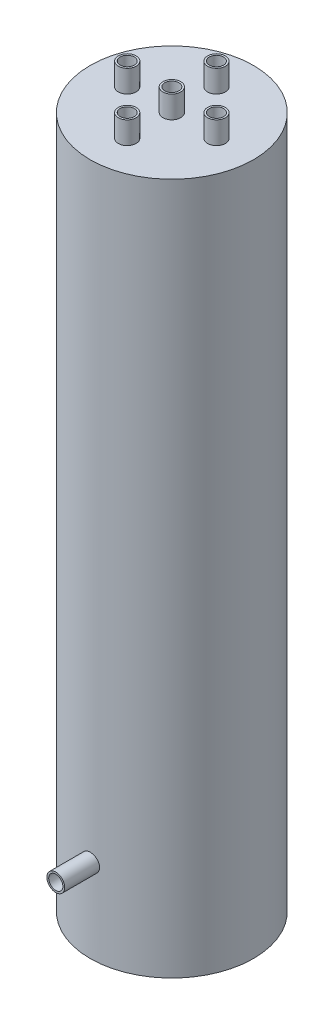
ISO-10303-21;
HEADER;
FILE_DESCRIPTION(('STEP AP214'),'2;1');
FILE_NAME('part.step','',(''),(''),'','','');
FILE_SCHEMA(('AUTOMOTIVE_DESIGN { 1 0 10303 214 1 1 1 1 }'));
ENDSEC;
DATA;
#1=APPLICATION_CONTEXT('core data for automotive mechanical design processes');
#2=APPLICATION_PROTOCOL_DEFINITION('international standard','automotive_design',2000,#1);
#3=PRODUCT_CONTEXT('',#1,'mechanical');
#4=PRODUCT('Part','Part','',(#3));
#5=PRODUCT_RELATED_PRODUCT_CATEGORY('part','',(#4));
#6=PRODUCT_DEFINITION_FORMATION('','',#4);
#7=PRODUCT_DEFINITION_CONTEXT('part definition',#1,'design');
#8=PRODUCT_DEFINITION('design','',#6,#7);
#9=PRODUCT_DEFINITION_SHAPE('','',#8);
#10=(LENGTH_UNIT() NAMED_UNIT(*) SI_UNIT(.MILLI.,.METRE.));
#11=(NAMED_UNIT(*) PLANE_ANGLE_UNIT() SI_UNIT($,.RADIAN.));
#12=(NAMED_UNIT(*) SI_UNIT($,.STERADIAN.) SOLID_ANGLE_UNIT());
#13=UNCERTAINTY_MEASURE_WITH_UNIT(LENGTH_MEASURE(1.E-05),#10,'distance_accuracy_value','');
#14=(GEOMETRIC_REPRESENTATION_CONTEXT(3) GLOBAL_UNCERTAINTY_ASSIGNED_CONTEXT((#13)) GLOBAL_UNIT_ASSIGNED_CONTEXT((#10,
#11,#12)) REPRESENTATION_CONTEXT('',''));
#15=CARTESIAN_POINT('',(0.,0.,0.));
#16=DIRECTION('',(0.,0.,1.));
#17=DIRECTION('',(1.,0.,0.));
#18=AXIS2_PLACEMENT_3D('',#15,#16,#17);
#19=CARTESIAN_POINT('',(0.,155.,0.));
#20=DIRECTION('',(0.,1.,0.));
#21=DIRECTION('',(0.,0.,1.));
#22=AXIS2_PLACEMENT_3D('',#19,#20,#21);
#23=PLANE('',#22);
#24=CARTESIAN_POINT('',(20.,155.,0.));
#25=DIRECTION('',(0.,1.,0.));
#26=DIRECTION('',(0.,0.,1.));
#27=AXIS2_PLACEMENT_3D('',#24,#25,#26);
#28=CIRCLE('',#27,4.);
#29=CARTESIAN_POINT('',(20.,155.,4.));
#30=VERTEX_POINT('',#29);
#31=EDGE_CURVE('E167',#30,#30,#28,.T.);
#32=ORIENTED_EDGE('',*,*,#31,.F.);
#33=EDGE_LOOP('',(#32));
#34=FACE_BOUND('',#33,.T.);
#35=CARTESIAN_POINT('',(0.,155.,20.));
#36=DIRECTION('',(0.,1.,0.));
#37=DIRECTION('',(0.,0.,1.));
#38=AXIS2_PLACEMENT_3D('',#35,#36,#37);
#39=CIRCLE('',#38,4.);
#40=CARTESIAN_POINT('',(0.,155.,24.));
#41=VERTEX_POINT('',#40);
#42=EDGE_CURVE('E191',#41,#41,#39,.T.);
#43=ORIENTED_EDGE('',*,*,#42,.F.);
#44=EDGE_LOOP('',(#43));
#45=FACE_BOUND('',#44,.T.);
#46=CARTESIAN_POINT('',(0.,155.,0.));
#47=DIRECTION('',(0.,1.,0.));
#48=DIRECTION('',(0.,0.,1.));
#49=AXIS2_PLACEMENT_3D('',#46,#47,#48);
#50=CIRCLE('',#49,36.6);
#51=CARTESIAN_POINT('',(0.,155.,36.6));
#52=VERTEX_POINT('',#51);
#53=EDGE_CURVE('E73',#52,#52,#50,.T.);
#54=ORIENTED_EDGE('',*,*,#53,.T.);
#55=EDGE_LOOP('',(#54));
#56=FACE_BOUND('',#55,.T.);
#57=CARTESIAN_POINT('',(0.,155.,0.));
#58=DIRECTION('',(0.,1.,0.));
#59=DIRECTION('',(0.,0.,1.));
#60=AXIS2_PLACEMENT_3D('',#57,#58,#59);
#61=CIRCLE('',#60,4.);
#62=CARTESIAN_POINT('',(0.,155.,4.));
#63=VERTEX_POINT('',#62);
#64=EDGE_CURVE('E150',#63,#63,#61,.T.);
#65=ORIENTED_EDGE('',*,*,#64,.F.);
#66=EDGE_LOOP('',(#65));
#67=FACE_BOUND('',#66,.T.);
#68=CARTESIAN_POINT('',(-20.,155.,0.));
#69=DIRECTION('',(0.,1.,0.));
#70=DIRECTION('',(0.,0.,1.));
#71=AXIS2_PLACEMENT_3D('',#68,#69,#70);
#72=CIRCLE('',#71,4.);
#73=CARTESIAN_POINT('',(-20.,155.,4.));
#74=VERTEX_POINT('',#73);
#75=EDGE_CURVE('E203',#74,#74,#72,.T.);
#76=ORIENTED_EDGE('',*,*,#75,.F.);
#77=EDGE_LOOP('',(#76));
#78=FACE_BOUND('',#77,.T.);
#79=CARTESIAN_POINT('',(0.,155.,-20.));
#80=DIRECTION('',(0.,1.,0.));
#81=DIRECTION('',(0.,0.,1.));
#82=AXIS2_PLACEMENT_3D('',#79,#80,#81);
#83=CIRCLE('',#82,4.);
#84=CARTESIAN_POINT('',(0.,155.,-16.));
#85=VERTEX_POINT('',#84);
#86=EDGE_CURVE('E179',#85,#85,#83,.T.);
#87=ORIENTED_EDGE('',*,*,#86,.F.);
#88=EDGE_LOOP('',(#87));
#89=FACE_BOUND('',#88,.T.);
#90=ADVANCED_FACE('F45',(#34,#45,#56,#67,#78,#89),#23,.T.);
#91=CARTESIAN_POINT('',(0.,140.,0.));
#92=DIRECTION('',(0.,-1.,0.));
#93=DIRECTION('',(0.,0.,-1.));
#94=AXIS2_PLACEMENT_3D('',#91,#92,#93);
#95=CYLINDRICAL_SURFACE('',#94,36.6);
#96=ORIENTED_EDGE('',*,*,#53,.F.);
#97=EDGE_LOOP('',(#96));
#98=FACE_BOUND('',#97,.T.);
#99=CARTESIAN_POINT('',(-4.,-117.704465642656,36.3807641481044));
#100=CARTESIAN_POINT('',(-3.99999035652888,-117.928426372424,36.3807669993321));
#101=CARTESIAN_POINT('',(-3.98112720598535,-118.152532387397,36.3828545094847));
#102=CARTESIAN_POINT('',(-3.9061679169019,-118.594522888859,36.3909771577017));
#103=CARTESIAN_POINT('',(-3.8500314810143,-118.812400375277,36.3970165681901));
#104=CARTESIAN_POINT('',(-3.70218690514282,-119.235469615529,36.4123509437496));
#105=CARTESIAN_POINT('',(-3.61050122084239,-119.440669282988,36.4216438532975));
#106=CARTESIAN_POINT('',(-3.39420570859501,-119.832725850075,36.4424356431216));
#107=CARTESIAN_POINT('',(-3.26960210363548,-120.019586207522,36.4539341063351));
#108=CARTESIAN_POINT('',(-2.99043106287914,-120.370508141754,36.4778969731229));
#109=CARTESIAN_POINT('',(-2.83575031431316,-120.534479341485,36.4903649190496));
#110=CARTESIAN_POINT('',(-2.5010587392878,-120.834189280795,36.5148298903671));
#111=CARTESIAN_POINT('',(-2.32104672027428,-120.969926690428,36.5268268935527));
#112=CARTESIAN_POINT('',(-1.94024302018696,-121.209633077633,36.5490337561589));
#113=CARTESIAN_POINT('',(-1.73940024547081,-121.313521345712,36.5592390476869));
#114=CARTESIAN_POINT('',(-1.32298996133603,-121.486063917528,36.5766739242199));
#115=CARTESIAN_POINT('',(-1.1074228756886,-121.554719234799,36.5839035948223));
#116=CARTESIAN_POINT('',(-0.668601044910458,-121.654579981154,36.59454774167));
#117=CARTESIAN_POINT('',(-0.445380629073005,-121.68593461916,36.5979774147296));
#118=CARTESIAN_POINT('',(0.00317858969439873,-121.710765901461,36.6006868992954));
#119=CARTESIAN_POINT('',(0.228517327642828,-121.704243703904,36.5999668376864));
#120=CARTESIAN_POINT('',(0.673902967808854,-121.653627039217,36.5944703713855));
#121=CARTESIAN_POINT('',(0.893968348562725,-121.609693023786,36.5897112895231));
#122=CARTESIAN_POINT('',(1.32358337108291,-121.485750108312,36.5766912759823));
#123=CARTESIAN_POINT('',(1.5331328537434,-121.40574066263,36.568430291338));
#124=CARTESIAN_POINT('',(1.93627038424834,-121.211743972346,36.549305187422));
#125=CARTESIAN_POINT('',(2.12982425983039,-121.097686268399,36.5384356793175));
#126=CARTESIAN_POINT('',(2.49510345127962,-120.83888192986,36.5153119568688));
#127=CARTESIAN_POINT('',(2.66682800146579,-120.694134219267,36.5030576939818));
#128=CARTESIAN_POINT('',(2.98451470707807,-120.377157610574,36.4784627538918));
#129=CARTESIAN_POINT('',(3.13033753097613,-120.204789042152,36.4661219597756));
#130=CARTESIAN_POINT('',(3.39100126516048,-119.837946329006,36.442808497001));
#131=CARTESIAN_POINT('',(3.5058421149103,-119.64347214109,36.4318358310158));
#132=CARTESIAN_POINT('',(3.70128428987256,-119.237825626607,36.4125004554348));
#133=CARTESIAN_POINT('',(3.78187612675795,-119.026648691915,36.4041384692703));
#134=CARTESIAN_POINT('',(3.90641773252441,-118.593648129357,36.390985939005));
#135=CARTESIAN_POINT('',(3.95036884038574,-118.371824890857,36.3861952643968));
#136=CARTESIAN_POINT('',(4.00020032405059,-117.925054197859,36.380750870905));
#137=CARTESIAN_POINT('',(4.00627602400726,-117.7001287776,36.3800759275167));
#138=CARTESIAN_POINT('',(3.98069802113483,-117.25246315781,36.3828833697791));
#139=CARTESIAN_POINT('',(3.94904492930606,-117.029722922949,36.3863656881048));
#140=CARTESIAN_POINT('',(3.84907164027095,-116.593325310592,36.3970759599516));
#141=CARTESIAN_POINT('',(3.78084456775558,-116.379646345875,36.4042943989576));
#142=CARTESIAN_POINT('',(3.60975537475998,-115.966764328915,36.4216558698257));
#143=CARTESIAN_POINT('',(3.50689231250161,-115.767561670473,36.4317989812108));
#144=CARTESIAN_POINT('',(3.26896488108602,-115.388398874915,36.4539181318825));
#145=CARTESIAN_POINT('',(3.13377154307566,-115.208520097532,36.4659014415928));
#146=CARTESIAN_POINT('',(2.83520517084069,-114.873937965385,36.4903273330595));
#147=CARTESIAN_POINT('',(2.67183130211562,-114.719235356418,36.502769928408));
#148=CARTESIAN_POINT('',(2.32069203685762,-114.438719075297,36.5267769055328));
#149=CARTESIAN_POINT('',(2.13282427500459,-114.31303314686,36.5383372593789));
#150=CARTESIAN_POINT('',(1.73853299261773,-114.094998702915,36.5592180549055));
#151=CARTESIAN_POINT('',(1.5321097688284,-114.002649654393,36.568538532398));
#152=CARTESIAN_POINT('',(1.10700563058654,-113.854124975946,36.5838713408991));
#153=CARTESIAN_POINT('',(0.888351529620701,-113.797873347466,36.5898906182551));
#154=CARTESIAN_POINT('',(0.444632432905874,-113.722892513877,36.5979714475269));
#155=CARTESIAN_POINT('',(0.219567655147246,-113.704162034428,36.6000331338551));
#156=CARTESIAN_POINT('',(-0.229331916796197,-113.704775125326,36.5999662238829));
#157=CARTESIAN_POINT('',(-0.453167010550648,-113.723920856505,36.5978594009884));
#158=CARTESIAN_POINT('',(-0.89441989290431,-113.799326594311,36.5897352414083));
#159=CARTESIAN_POINT('',(-1.11183767935968,-113.855586613337,36.5837179034164));
#160=CARTESIAN_POINT('',(-1.53407412202718,-114.003566480515,36.5684464577648));
#161=CARTESIAN_POINT('',(-1.73889529062642,-114.095279230884,36.5591929980254));
#162=CARTESIAN_POINT('',(-2.13026912503323,-114.311540464015,36.5384784200657));
#163=CARTESIAN_POINT('',(-2.31682178408818,-114.436088958914,36.5270173010294));
#164=CARTESIAN_POINT('',(-2.66737627612683,-114.715225290715,36.5030982063327));
#165=CARTESIAN_POINT('',(-2.83126041028886,-114.8699605418,36.4906355227707));
#166=CARTESIAN_POINT('',(-3.1308203376118,-115.204779787501,36.4661571232197));
#167=CARTESIAN_POINT('',(-3.26648938611352,-115.384869825824,36.4541415146638));
#168=CARTESIAN_POINT('',(-3.5060991158987,-115.765887491489,36.4318794042668));
#169=CARTESIAN_POINT('',(-3.6099438286756,-115.966875745056,36.4216382931272));
#170=CARTESIAN_POINT('',(-3.78226745332456,-116.383426346305,36.4041484324315));
#171=CARTESIAN_POINT('',(-3.85078576417122,-116.598972153288,36.3968963510772));
#172=CARTESIAN_POINT('',(-3.93365965674848,-116.963830602533,36.3880111821422));
#173=CARTESIAN_POINT('',(-3.95850268084169,-117.110820671771,36.3853066293041));
#174=CARTESIAN_POINT('',(-3.99167601523004,-117.406674300319,36.3816821689987));
#175=CARTESIAN_POINT('',(-4.00000641264597,-117.555537849741,36.3807622521156));
#176=CARTESIAN_POINT('',(-4.,-117.704465642656,36.3807641481044));
#177=B_SPLINE_CURVE_WITH_KNOTS('',3,(#99,#100,#101,#102,#103,#104,#105,#106,#107,#108,#109,#110,
#111,#112,#113,#114,#115,#116,#117,#118,#119,#120,#121,#122,#123,#124,#125,#126,#127,#128,#129,
#130,#131,#132,#133,#134,#135,#136,#137,#138,#139,#140,#141,#142,#143,#144,#145,#146,#147,#148,
#149,#150,#151,#152,#153,#154,#155,#156,#157,#158,#159,#160,#161,#162,#163,#164,#165,#166,#167,
#168,#169,#170,#171,#172,#173,#174,#175,#176),.UNSPECIFIED.,.T.,.F.,(4,2,2,2,2,2,2,2,2,2,2,2,2,
2,2,2,2,2,2,2,2,2,2,2,2,2,2,2,2,2,2,2,2,2,2,2,2,2,4),(0.,0.671338265123541,1.34340352002231,
2.01504493580429,2.68655947149108,3.36065468370503,4.03478164182587,4.71060305945429,
5.3864050348775,6.05949450125936,6.73256338693227,7.40276007174004,8.07296689358674,
8.74457036860916,9.41619739416307,10.0913345197562,10.7664729645076,11.4417983274901,
12.1170990106427,12.7889142554371,13.4607186206421,14.1308205059564,14.8009406133074,
15.4737798508492,16.1466390163716,16.8224061887043,17.4981625558876,18.1724914948341,
18.8467975310298,19.517590756934,20.1883842069286,20.8590434308025,21.5297029025727,
22.2037233859915,22.8779048055291,23.5540997027036,24.2295388101577,24.6759628494628,
25.1223845334235),.UNSPECIFIED.);
#178=CARTESIAN_POINT('',(-4.,-117.704465642656,36.3807641481044));
#179=VERTEX_POINT('',#178);
#180=EDGE_CURVE('E10',#179,#179,#177,.T.);
#181=ORIENTED_EDGE('',*,*,#180,.F.);
#182=EDGE_LOOP('',(#181));
#183=FACE_BOUND('',#182,.T.);
#184=CARTESIAN_POINT('',(0.,-155.,0.));
#185=DIRECTION('',(0.,-1.,0.));
#186=DIRECTION('',(0.,0.,-1.));
#187=AXIS2_PLACEMENT_3D('',#184,#185,#186);
#188=CIRCLE('',#187,36.6);
#189=CARTESIAN_POINT('',(0.,-155.,-36.6));
#190=VERTEX_POINT('',#189);
#191=EDGE_CURVE('E196',#190,#190,#188,.T.);
#192=ORIENTED_EDGE('',*,*,#191,.F.);
#193=EDGE_LOOP('',(#192));
#194=FACE_BOUND('',#193,.T.);
#195=ADVANCED_FACE('F47',(#98,#183,#194),#95,.T.);
#196=CARTESIAN_POINT('',(0.,140.,0.));
#197=DIRECTION('',(0.,-1.,0.));
#198=DIRECTION('',(0.,0.,-1.));
#199=AXIS2_PLACEMENT_3D('',#196,#197,#198);
#200=CYLINDRICAL_SURFACE('',#199,29.45);
#201=CARTESIAN_POINT('',(0.,140.,0.));
#202=DIRECTION('',(0.,1.,0.));
#203=DIRECTION('',(0.,0.,1.));
#204=AXIS2_PLACEMENT_3D('',#201,#202,#203);
#205=CIRCLE('',#204,29.45);
#206=CARTESIAN_POINT('',(0.,140.,29.45));
#207=VERTEX_POINT('',#206);
#208=EDGE_CURVE('E65',#207,#207,#205,.T.);
#209=ORIENTED_EDGE('',*,*,#208,.T.);
#210=EDGE_LOOP('',(#209));
#211=FACE_BOUND('',#210,.T.);
#212=CARTESIAN_POINT('',(0.,-140.,0.));
#213=DIRECTION('',(0.,1.,0.));
#214=DIRECTION('',(0.,0.,1.));
#215=AXIS2_PLACEMENT_3D('',#212,#213,#214);
#216=CIRCLE('',#215,29.45);
#217=CARTESIAN_POINT('',(0.,-140.,29.45));
#218=VERTEX_POINT('',#217);
#219=EDGE_CURVE('E59',#218,#218,#216,.T.);
#220=ORIENTED_EDGE('',*,*,#219,.F.);
#221=EDGE_LOOP('',(#220));
#222=FACE_BOUND('',#221,.T.);
#223=CARTESIAN_POINT('',(-4.,-117.704465642656,29.1770886141849));
#224=CARTESIAN_POINT('',(-3.99999059923412,-117.928032757557,29.1770920625913));
#225=CARTESIAN_POINT('',(-3.98119335127821,-118.151735522596,29.1796859809164));
#226=CARTESIAN_POINT('',(-3.90651131179563,-118.59290355315,29.189776197825));
#227=CARTESIAN_POINT('',(-3.85058882590191,-118.810362244518,29.1972774788881));
#228=CARTESIAN_POINT('',(-3.70334561580655,-119.232591534859,29.2163174669683));
#229=CARTESIAN_POINT('',(-3.61205020564359,-119.437371086174,29.2278532861625));
#230=CARTESIAN_POINT('',(-3.39670923224473,-119.828669367865,29.2536591016489));
#231=CARTESIAN_POINT('',(-3.27266881784499,-120.015190962813,29.267928667989));
#232=CARTESIAN_POINT('',(-2.99448517096283,-120.365941300651,29.2976993137225));
#233=CARTESIAN_POINT('',(-2.84016907558873,-120.530032387075,29.3132071465075));
#234=CARTESIAN_POINT('',(-2.50618725102693,-120.830073070547,29.3436464518501));
#235=CARTESIAN_POINT('',(-2.3265202081957,-120.966021208374,29.358577894489));
#236=CARTESIAN_POINT('',(-1.94606389754352,-121.206416992607,29.3862518795036));
#237=CARTESIAN_POINT('',(-1.74519460239925,-121.310739086163,29.3989856132302));
#238=CARTESIAN_POINT('',(-1.32858477777713,-121.48411667226,29.4207549534958));
#239=CARTESIAN_POINT('',(-1.11284489641397,-121.553173700681,29.4297907210868));
#240=CARTESIAN_POINT('',(-0.674030550004465,-121.653646919717,29.4430984408265));
#241=CARTESIAN_POINT('',(-0.451009563495173,-121.685292766503,29.4473994469356));
#242=CARTESIAN_POINT('',(-0.00278400487312738,-121.710757611305,29.4508524065689));
#243=CARTESIAN_POINT('',(0.222420466251848,-121.704578350507,29.4500045971061));
#244=CARTESIAN_POINT('',(0.667055977877699,-121.654751275789,29.4432788359242));
#245=CARTESIAN_POINT('',(0.886515272815174,-121.611350483819,29.4374340476205));
#246=CARTESIAN_POINT('',(1.31500663485693,-121.488699139564,29.4214081198679));
#247=CARTESIAN_POINT('',(1.5240384739637,-121.409447803784,29.4112268856486));
#248=CARTESIAN_POINT('',(1.92649899615937,-121.217086384951,29.3876148704012));
#249=CARTESIAN_POINT('',(2.11987654017966,-121.103870600795,29.3741739703258));
#250=CARTESIAN_POINT('',(2.48498143160484,-120.846871065468,29.345544038907));
#251=CARTESIAN_POINT('',(2.65670760704207,-120.703085660723,29.3303549130189));
#252=CARTESIAN_POINT('',(2.97508838315365,-120.387647901647,29.2997813350935));
#253=CARTESIAN_POINT('',(3.12152954939903,-120.215780095536,29.2843962958272));
#254=CARTESIAN_POINT('',(3.38352134464688,-119.849792991105,29.2552852279672));
#255=CARTESIAN_POINT('',(3.49907184250518,-119.655673598323,29.2415592064169));
#256=CARTESIAN_POINT('',(3.69602123822044,-119.250490245905,29.217320663271));
#257=CARTESIAN_POINT('',(3.77740105530245,-119.039416897399,29.2068099379712));
#258=CARTESIAN_POINT('',(3.90349933702147,-118.606425017323,29.1902256824482));
#259=CARTESIAN_POINT('',(3.94821990089893,-118.384507107523,29.1841518981519));
#260=CARTESIAN_POINT('',(3.99944344391486,-117.938016291378,29.177176455681));
#261=CARTESIAN_POINT('',(4.00624768860899,-117.713478561261,29.1762340274987));
#262=CARTESIAN_POINT('',(3.98224219450928,-117.266466258736,29.1795200118231));
#263=CARTESIAN_POINT('',(3.95143340657282,-117.043991634314,29.1837482936144));
#264=CARTESIAN_POINT('',(3.85333082824004,-116.608336105856,29.1968619766888));
#265=CARTESIAN_POINT('',(3.78618464487633,-116.395121346591,29.2057285319001));
#266=CARTESIAN_POINT('',(3.61746590625275,-115.98297531486,29.2271043497648));
#267=CARTESIAN_POINT('',(3.51589193684769,-115.784044629528,29.2396137620482));
#268=CARTESIAN_POINT('',(3.28046718250858,-115.404755777052,29.2669628136222));
#269=CARTESIAN_POINT('',(3.14641987910081,-115.224520614493,29.281816440967));
#270=CARTESIAN_POINT('',(2.85012946306006,-114.888997940217,29.3121371379818));
#271=CARTESIAN_POINT('',(2.68788505066832,-114.733711579163,29.3276042359047));
#272=CARTESIAN_POINT('',(2.33848545023311,-114.451426503765,29.3575352815521));
#273=CARTESIAN_POINT('',(2.15116902329133,-114.324626452921,29.3719917274954));
#274=CARTESIAN_POINT('',(1.75772075538248,-114.104291888395,29.3981586952915));
#275=CARTESIAN_POINT('',(1.5515893512016,-114.010756602725,29.4098692808664));
#276=CARTESIAN_POINT('',(1.12700611430435,-113.859930401408,29.4291919541032));
#277=CARTESIAN_POINT('',(0.908594759789853,-113.802527230238,29.4368167245199));
#278=CARTESIAN_POINT('',(0.465122714301941,-113.725230265465,29.4471615743977));
#279=CARTESIAN_POINT('',(0.240062380864624,-113.705334458691,29.449881917099));
#280=CARTESIAN_POINT('',(-0.208384620947759,-113.703659343031,29.4501095911116));
#281=CARTESIAN_POINT('',(-0.431770188473238,-113.721574691608,29.4476586827096));
#282=CARTESIAN_POINT('',(-0.872322968239064,-113.794363432765,29.4379027142973));
#283=CARTESIAN_POINT('',(-1.08949019064606,-113.849236764918,29.4305976622238));
#284=CARTESIAN_POINT('',(-1.51138349245303,-113.994282694678,29.4119503456281));
#285=CARTESIAN_POINT('',(-1.71611562652751,-114.084437951662,29.4006100646185));
#286=CARTESIAN_POINT('',(-2.10759409790266,-114.297456693395,29.3751438137079));
#287=CARTESIAN_POINT('',(-2.29434006660592,-114.420320848267,29.3610177867356));
#288=CARTESIAN_POINT('',(-2.64610092464381,-114.696389384555,29.3314182289606));
#289=CARTESIAN_POINT('',(-2.81093718660263,-114.849820362229,29.3159351495391));
#290=CARTESIAN_POINT('',(-3.11263847449486,-115.18219253172,29.2854406996697));
#291=CARTESIAN_POINT('',(-3.24949689646695,-115.361139729569,29.2704294412976));
#292=CARTESIAN_POINT('',(-3.49190454664917,-115.740413260764,29.2425050888401));
#293=CARTESIAN_POINT('',(-3.597308021312,-115.940833445615,29.2296018839851));
#294=CARTESIAN_POINT('',(-3.77280664324117,-116.356601414527,29.2074703362257));
#295=CARTESIAN_POINT('',(-3.84293947237838,-116.571932986685,29.1982380736385));
#296=CARTESIAN_POINT('',(-3.9294721877679,-116.941011677615,29.1866910698592));
#297=CARTESIAN_POINT('',(-3.95588109936663,-117.092449435322,29.1831085521151));
#298=CARTESIAN_POINT('',(-3.99114814978552,-117.397392021338,29.1783061512804));
#299=CARTESIAN_POINT('',(-4.0000064574097,-117.550896829752,29.177086245466));
#300=CARTESIAN_POINT('',(-4.,-117.704465642656,29.1770886141849));
#301=B_SPLINE_CURVE_WITH_KNOTS('',3,(#223,#224,#225,#226,#227,#228,#229,#230,#231,#232,#233,
#234,#235,#236,#237,#238,#239,#240,#241,#242,#243,#244,#245,#246,#247,#248,#249,#250,#251,#252,
#253,#254,#255,#256,#257,#258,#259,#260,#261,#262,#263,#264,#265,#266,#267,#268,#269,#270,#271,
#272,#273,#274,#275,#276,#277,#278,#279,#280,#281,#282,#283,#284,#285,#286,#287,#288,#289,#290,
#291,#292,#293,#294,#295,#296,#297,#298,#299,#300),.UNSPECIFIED.,.T.,.F.,(4,2,2,2,2,2,2,2,2,2,2,
2,2,2,2,2,2,2,2,2,2,2,2,2,2,2,2,2,2,2,2,2,2,2,2,2,2,2,4),(0.,0.670140214352792,1.34096188491918,
2.01130437727984,2.68154152746604,3.35572311048829,4.02993964130676,4.70679872598836,
5.38362832929874,6.05628113732559,6.72890298167735,7.3970951888075,8.065301999638,
8.73561030523898,9.40595487841805,10.0817072825525,10.7574625555012,11.4335946673611,
12.1096880587636,12.7804017810908,13.4510985481274,14.119091090567,14.7871110745894,
15.4592793885773,16.131478694696,16.8082296506933,17.4849649000371,18.1595871489322,
18.8341731871023,19.5033324838685,20.1724906865336,20.8413204185365,21.5101638542097,
22.1841635240075,22.8583221031923,23.5355576997659,24.2120682172669,24.6723936416259,
25.1327146384926),.UNSPECIFIED.);
#302=CARTESIAN_POINT('',(-4.,-117.704465642656,29.1770886141849));
#303=VERTEX_POINT('',#302);
#304=EDGE_CURVE('E50',#303,#303,#301,.T.);
#305=ORIENTED_EDGE('',*,*,#304,.T.);
#306=EDGE_LOOP('',(#305));
#307=FACE_BOUND('',#306,.T.);
#308=ADVANCED_FACE('F94',(#211,#222,#307),#200,.F.);
#309=CARTESIAN_POINT('',(0.,140.,0.));
#310=DIRECTION('',(0.,1.,0.));
#311=DIRECTION('',(0.,0.,1.));
#312=AXIS2_PLACEMENT_3D('',#309,#310,#311);
#313=PLANE('',#312);
#314=CARTESIAN_POINT('',(0.,140.,-20.));
#315=DIRECTION('',(0.,1.,0.));
#316=DIRECTION('',(0.,0.,1.));
#317=AXIS2_PLACEMENT_3D('',#314,#315,#316);
#318=CIRCLE('',#317,3.175);
#319=CARTESIAN_POINT('',(0.,140.,-16.825));
#320=VERTEX_POINT('',#319);
#321=EDGE_CURVE('E126',#320,#320,#318,.T.);
#322=ORIENTED_EDGE('',*,*,#321,.T.);
#323=EDGE_LOOP('',(#322));
#324=FACE_BOUND('',#323,.T.);
#325=CARTESIAN_POINT('',(0.,140.,20.));
#326=DIRECTION('',(0.,1.,0.));
#327=DIRECTION('',(0.,0.,1.));
#328=AXIS2_PLACEMENT_3D('',#325,#326,#327);
#329=CIRCLE('',#328,3.175);
#330=CARTESIAN_POINT('',(0.,140.,23.175));
#331=VERTEX_POINT('',#330);
#332=EDGE_CURVE('E133',#331,#331,#329,.T.);
#333=ORIENTED_EDGE('',*,*,#332,.T.);
#334=EDGE_LOOP('',(#333));
#335=FACE_BOUND('',#334,.T.);
#336=CARTESIAN_POINT('',(20.,140.,0.));
#337=DIRECTION('',(0.,1.,0.));
#338=DIRECTION('',(0.,0.,1.));
#339=AXIS2_PLACEMENT_3D('',#336,#337,#338);
#340=CIRCLE('',#339,3.175);
#341=CARTESIAN_POINT('',(20.,140.,3.175));
#342=VERTEX_POINT('',#341);
#343=EDGE_CURVE('E137',#342,#342,#340,.T.);
#344=ORIENTED_EDGE('',*,*,#343,.T.);
#345=EDGE_LOOP('',(#344));
#346=FACE_BOUND('',#345,.T.);
#347=CARTESIAN_POINT('',(-20.,140.,0.));
#348=DIRECTION('',(0.,1.,0.));
#349=DIRECTION('',(0.,0.,1.));
#350=AXIS2_PLACEMENT_3D('',#347,#348,#349);
#351=CIRCLE('',#350,3.175);
#352=CARTESIAN_POINT('',(-20.,140.,3.175));
#353=VERTEX_POINT('',#352);
#354=EDGE_CURVE('E141',#353,#353,#351,.T.);
#355=ORIENTED_EDGE('',*,*,#354,.T.);
#356=EDGE_LOOP('',(#355));
#357=FACE_BOUND('',#356,.T.);
#358=CARTESIAN_POINT('',(0.,140.,0.));
#359=DIRECTION('',(0.,1.,0.));
#360=DIRECTION('',(0.,0.,1.));
#361=AXIS2_PLACEMENT_3D('',#358,#359,#360);
#362=CIRCLE('',#361,3.175);
#363=CARTESIAN_POINT('',(0.,140.,3.175));
#364=VERTEX_POINT('',#363);
#365=EDGE_CURVE('E145',#364,#364,#362,.T.);
#366=ORIENTED_EDGE('',*,*,#365,.T.);
#367=EDGE_LOOP('',(#366));
#368=FACE_BOUND('',#367,.T.);
#369=ORIENTED_EDGE('',*,*,#208,.F.);
#370=EDGE_LOOP('',(#369));
#371=FACE_BOUND('',#370,.T.);
#372=ADVANCED_FACE('F81',(#324,#335,#346,#357,#368,#371),#313,.F.);
#373=CARTESIAN_POINT('',(0.,-117.704465642656,52.));
#374=DIRECTION('',(0.,0.,-1.));
#375=DIRECTION('',(-1.,0.,0.));
#376=AXIS2_PLACEMENT_3D('',#373,#374,#375);
#377=CYLINDRICAL_SURFACE('',#376,4.);
#378=ORIENTED_EDGE('',*,*,#304,.F.);
#379=EDGE_LOOP('',(#378));
#380=FACE_BOUND('',#379,.T.);
#381=CARTESIAN_POINT('',(0.,-117.704465642656,0.));
#382=DIRECTION('',(0.,0.,1.));
#383=DIRECTION('',(1.,0.,0.));
#384=AXIS2_PLACEMENT_3D('',#381,#382,#383);
#385=CIRCLE('',#384,4.);
#386=CARTESIAN_POINT('',(4.,-117.704465642656,0.));
#387=VERTEX_POINT('',#386);
#388=EDGE_CURVE('E71',#387,#387,#385,.T.);
#389=ORIENTED_EDGE('',*,*,#388,.T.);
#390=EDGE_LOOP('',(#389));
#391=FACE_BOUND('',#390,.T.);
#392=ADVANCED_FACE('F75',(#380,#391),#377,.T.);
#393=CARTESIAN_POINT('',(0.,-117.704465642656,0.));
#394=DIRECTION('',(0.,0.,1.));
#395=DIRECTION('',(1.,0.,0.));
#396=AXIS2_PLACEMENT_3D('',#393,#394,#395);
#397=PLANE('',#396);
#398=ORIENTED_EDGE('',*,*,#388,.F.);
#399=EDGE_LOOP('',(#398));
#400=FACE_BOUND('',#399,.T.);
#401=CARTESIAN_POINT('',(0.,-117.704465642656,0.));
#402=DIRECTION('',(0.,0.,1.));
#403=DIRECTION('',(1.,0.,0.));
#404=AXIS2_PLACEMENT_3D('',#401,#402,#403);
#405=CIRCLE('',#404,3.175);
#406=CARTESIAN_POINT('',(3.175,-117.704465642656,0.));
#407=VERTEX_POINT('',#406);
#408=EDGE_CURVE('E122',#407,#407,#405,.T.);
#409=ORIENTED_EDGE('',*,*,#408,.T.);
#410=EDGE_LOOP('',(#409));
#411=FACE_BOUND('',#410,.T.);
#412=ADVANCED_FACE('F80',(#400,#411),#397,.F.);
#413=CARTESIAN_POINT('',(0.,-117.704465642656,52.));
#414=DIRECTION('',(0.,0.,-1.));
#415=DIRECTION('',(-1.,0.,0.));
#416=AXIS2_PLACEMENT_3D('',#413,#414,#415);
#417=CYLINDRICAL_SURFACE('',#416,3.175);
#418=ORIENTED_EDGE('',*,*,#408,.F.);
#419=EDGE_LOOP('',(#418));
#420=FACE_BOUND('',#419,.T.);
#421=CARTESIAN_POINT('',(0.,-117.704465642656,52.));
#422=DIRECTION('',(0.,0.,1.));
#423=DIRECTION('',(1.,0.,0.));
#424=AXIS2_PLACEMENT_3D('',#421,#422,#423);
#425=CIRCLE('',#424,3.175);
#426=CARTESIAN_POINT('',(3.175,-117.704465642656,52.));
#427=VERTEX_POINT('',#426);
#428=EDGE_CURVE('E120',#427,#427,#425,.T.);
#429=ORIENTED_EDGE('',*,*,#428,.T.);
#430=EDGE_LOOP('',(#429));
#431=FACE_BOUND('',#430,.T.);
#432=ADVANCED_FACE('F85',(#420,#431),#417,.F.);
#433=CARTESIAN_POINT('',(0.,-117.704465642656,52.));
#434=DIRECTION('',(0.,0.,1.));
#435=DIRECTION('',(1.,0.,0.));
#436=AXIS2_PLACEMENT_3D('',#433,#434,#435);
#437=CIRCLE('',#436,4.);
#438=CARTESIAN_POINT('',(4.,-117.704465642656,52.));
#439=VERTEX_POINT('',#438);
#440=EDGE_CURVE('E111',#439,#439,#437,.T.);
#441=ORIENTED_EDGE('',*,*,#440,.F.);
#442=EDGE_LOOP('',(#441));
#443=FACE_BOUND('',#442,.T.);
#444=ORIENTED_EDGE('',*,*,#180,.T.);
#445=EDGE_LOOP('',(#444));
#446=FACE_BOUND('',#445,.T.);
#447=ADVANCED_FACE('F83',(#443,#446),#377,.T.);
#448=CARTESIAN_POINT('',(0.,-117.704465642656,52.));
#449=DIRECTION('',(0.,0.,1.));
#450=DIRECTION('',(1.,0.,0.));
#451=AXIS2_PLACEMENT_3D('',#448,#449,#450);
#452=PLANE('',#451);
#453=ORIENTED_EDGE('',*,*,#440,.T.);
#454=EDGE_LOOP('',(#453));
#455=FACE_BOUND('',#454,.T.);
#456=ORIENTED_EDGE('',*,*,#428,.F.);
#457=EDGE_LOOP('',(#456));
#458=FACE_BOUND('',#457,.T.);
#459=ADVANCED_FACE('F281',(#455,#458),#452,.T.);
#460=CARTESIAN_POINT('',(0.,103.,0.));
#461=DIRECTION('',(0.,1.,0.));
#462=DIRECTION('',(0.,0.,1.));
#463=AXIS2_PLACEMENT_3D('',#460,#461,#462);
#464=CYLINDRICAL_SURFACE('',#463,3.175);
#465=ORIENTED_EDGE('',*,*,#365,.F.);
#466=EDGE_LOOP('',(#465));
#467=FACE_BOUND('',#466,.T.);
#468=CARTESIAN_POINT('',(0.,165.,0.));
#469=DIRECTION('',(0.,1.,0.));
#470=DIRECTION('',(0.,0.,1.));
#471=AXIS2_PLACEMENT_3D('',#468,#469,#470);
#472=CIRCLE('',#471,3.175);
#473=CARTESIAN_POINT('',(0.,165.,3.175));
#474=VERTEX_POINT('',#473);
#475=EDGE_CURVE('E154',#474,#474,#472,.T.);
#476=ORIENTED_EDGE('',*,*,#475,.T.);
#477=EDGE_LOOP('',(#476));
#478=FACE_BOUND('',#477,.T.);
#479=ADVANCED_FACE('F278',(#467,#478),#464,.F.);
#480=CARTESIAN_POINT('',(-20.,103.,0.));
#481=DIRECTION('',(0.,1.,0.));
#482=DIRECTION('',(0.,0.,1.));
#483=AXIS2_PLACEMENT_3D('',#480,#481,#482);
#484=CYLINDRICAL_SURFACE('',#483,3.175);
#485=ORIENTED_EDGE('',*,*,#354,.F.);
#486=EDGE_LOOP('',(#485));
#487=FACE_BOUND('',#486,.T.);
#488=CARTESIAN_POINT('',(-20.,165.,0.));
#489=DIRECTION('',(0.,1.,0.));
#490=DIRECTION('',(0.,0.,1.));
#491=AXIS2_PLACEMENT_3D('',#488,#489,#490);
#492=CIRCLE('',#491,3.175);
#493=CARTESIAN_POINT('',(-20.,165.,3.175));
#494=VERTEX_POINT('',#493);
#495=EDGE_CURVE('E172',#494,#494,#492,.T.);
#496=ORIENTED_EDGE('',*,*,#495,.T.);
#497=EDGE_LOOP('',(#496));
#498=FACE_BOUND('',#497,.T.);
#499=ADVANCED_FACE('F273',(#487,#498),#484,.F.);
#500=CARTESIAN_POINT('',(20.,103.,0.));
#501=DIRECTION('',(0.,1.,0.));
#502=DIRECTION('',(0.,0.,1.));
#503=AXIS2_PLACEMENT_3D('',#500,#501,#502);
#504=CYLINDRICAL_SURFACE('',#503,3.175);
#505=ORIENTED_EDGE('',*,*,#343,.F.);
#506=EDGE_LOOP('',(#505));
#507=FACE_BOUND('',#506,.T.);
#508=CARTESIAN_POINT('',(20.,165.,0.));
#509=DIRECTION('',(0.,1.,0.));
#510=DIRECTION('',(0.,0.,1.));
#511=AXIS2_PLACEMENT_3D('',#508,#509,#510);
#512=CIRCLE('',#511,3.175);
#513=CARTESIAN_POINT('',(20.,165.,3.175));
#514=VERTEX_POINT('',#513);
#515=EDGE_CURVE('E162',#514,#514,#512,.T.);
#516=ORIENTED_EDGE('',*,*,#515,.T.);
#517=EDGE_LOOP('',(#516));
#518=FACE_BOUND('',#517,.T.);
#519=ADVANCED_FACE('F270',(#507,#518),#504,.F.);
#520=CARTESIAN_POINT('',(0.,103.,20.));
#521=DIRECTION('',(0.,1.,0.));
#522=DIRECTION('',(0.,0.,1.));
#523=AXIS2_PLACEMENT_3D('',#520,#521,#522);
#524=CYLINDRICAL_SURFACE('',#523,3.175);
#525=ORIENTED_EDGE('',*,*,#332,.F.);
#526=EDGE_LOOP('',(#525));
#527=FACE_BOUND('',#526,.T.);
#528=CARTESIAN_POINT('',(0.,165.,20.));
#529=DIRECTION('',(0.,1.,0.));
#530=DIRECTION('',(0.,0.,1.));
#531=AXIS2_PLACEMENT_3D('',#528,#529,#530);
#532=CIRCLE('',#531,3.175);
#533=CARTESIAN_POINT('',(0.,165.,23.175));
#534=VERTEX_POINT('',#533);
#535=EDGE_CURVE('E186',#534,#534,#532,.T.);
#536=ORIENTED_EDGE('',*,*,#535,.T.);
#537=EDGE_LOOP('',(#536));
#538=FACE_BOUND('',#537,.T.);
#539=ADVANCED_FACE('F268',(#527,#538),#524,.F.);
#540=CARTESIAN_POINT('',(0.,103.,-20.));
#541=DIRECTION('',(0.,1.,0.));
#542=DIRECTION('',(0.,0.,1.));
#543=AXIS2_PLACEMENT_3D('',#540,#541,#542);
#544=CYLINDRICAL_SURFACE('',#543,3.175);
#545=ORIENTED_EDGE('',*,*,#321,.F.);
#546=EDGE_LOOP('',(#545));
#547=FACE_BOUND('',#546,.T.);
#548=CARTESIAN_POINT('',(0.,165.,-20.));
#549=DIRECTION('',(0.,1.,0.));
#550=DIRECTION('',(0.,0.,1.));
#551=AXIS2_PLACEMENT_3D('',#548,#549,#550);
#552=CIRCLE('',#551,3.175);
#553=CARTESIAN_POINT('',(0.,165.,-16.825));
#554=VERTEX_POINT('',#553);
#555=EDGE_CURVE('E161',#554,#554,#552,.T.);
#556=ORIENTED_EDGE('',*,*,#555,.T.);
#557=EDGE_LOOP('',(#556));
#558=FACE_BOUND('',#557,.T.);
#559=ADVANCED_FACE('F252',(#547,#558),#544,.F.);
#560=CARTESIAN_POINT('',(0.,165.,-20.));
#561=DIRECTION('',(0.,1.,0.));
#562=DIRECTION('',(0.,0.,1.));
#563=AXIS2_PLACEMENT_3D('',#560,#561,#562);
#564=PLANE('',#563);
#565=CARTESIAN_POINT('',(0.,165.,-20.));
#566=DIRECTION('',(0.,1.,0.));
#567=DIRECTION('',(0.,0.,1.));
#568=AXIS2_PLACEMENT_3D('',#565,#566,#567);
#569=CIRCLE('',#568,4.);
#570=CARTESIAN_POINT('',(0.,165.,-16.));
#571=VERTEX_POINT('',#570);
#572=EDGE_CURVE('E166',#571,#571,#569,.T.);
#573=ORIENTED_EDGE('',*,*,#572,.T.);
#574=EDGE_LOOP('',(#573));
#575=FACE_BOUND('',#574,.T.);
#576=ORIENTED_EDGE('',*,*,#555,.F.);
#577=EDGE_LOOP('',(#576));
#578=FACE_BOUND('',#577,.T.);
#579=ADVANCED_FACE('F248',(#575,#578),#564,.T.);
#580=CARTESIAN_POINT('',(0.,165.,-20.));
#581=DIRECTION('',(0.,-1.,0.));
#582=DIRECTION('',(0.,0.,-1.));
#583=AXIS2_PLACEMENT_3D('',#580,#581,#582);
#584=CYLINDRICAL_SURFACE('',#583,4.);
#585=ORIENTED_EDGE('',*,*,#572,.F.);
#586=EDGE_LOOP('',(#585));
#587=FACE_BOUND('',#586,.T.);
#588=ORIENTED_EDGE('',*,*,#86,.T.);
#589=EDGE_LOOP('',(#588));
#590=FACE_BOUND('',#589,.T.);
#591=ADVANCED_FACE('F244',(#587,#590),#584,.T.);
#592=CARTESIAN_POINT('',(0.,165.,20.));
#593=DIRECTION('',(0.,1.,0.));
#594=DIRECTION('',(0.,0.,1.));
#595=AXIS2_PLACEMENT_3D('',#592,#593,#594);
#596=PLANE('',#595);
#597=CARTESIAN_POINT('',(0.,165.,20.));
#598=DIRECTION('',(0.,1.,0.));
#599=DIRECTION('',(0.,0.,1.));
#600=AXIS2_PLACEMENT_3D('',#597,#598,#599);
#601=CIRCLE('',#600,4.);
#602=CARTESIAN_POINT('',(0.,165.,24.));
#603=VERTEX_POINT('',#602);
#604=EDGE_CURVE('E192',#603,#603,#601,.T.);
#605=ORIENTED_EDGE('',*,*,#604,.T.);
#606=EDGE_LOOP('',(#605));
#607=FACE_BOUND('',#606,.T.);
#608=ORIENTED_EDGE('',*,*,#535,.F.);
#609=EDGE_LOOP('',(#608));
#610=FACE_BOUND('',#609,.T.);
#611=ADVANCED_FACE('F240',(#607,#610),#596,.T.);
#612=CARTESIAN_POINT('',(0.,165.,20.));
#613=DIRECTION('',(0.,-1.,0.));
#614=DIRECTION('',(0.,0.,-1.));
#615=AXIS2_PLACEMENT_3D('',#612,#613,#614);
#616=CYLINDRICAL_SURFACE('',#615,4.);
#617=ORIENTED_EDGE('',*,*,#604,.F.);
#618=EDGE_LOOP('',(#617));
#619=FACE_BOUND('',#618,.T.);
#620=ORIENTED_EDGE('',*,*,#42,.T.);
#621=EDGE_LOOP('',(#620));
#622=FACE_BOUND('',#621,.T.);
#623=ADVANCED_FACE('F236',(#619,#622),#616,.T.);
#624=CARTESIAN_POINT('',(20.,165.,0.));
#625=DIRECTION('',(0.,1.,0.));
#626=DIRECTION('',(0.,0.,1.));
#627=AXIS2_PLACEMENT_3D('',#624,#625,#626);
#628=PLANE('',#627);
#629=CARTESIAN_POINT('',(20.,165.,0.));
#630=DIRECTION('',(0.,1.,0.));
#631=DIRECTION('',(0.,0.,1.));
#632=AXIS2_PLACEMENT_3D('',#629,#630,#631);
#633=CIRCLE('',#632,4.);
#634=CARTESIAN_POINT('',(20.,165.,4.));
#635=VERTEX_POINT('',#634);
#636=EDGE_CURVE('E168',#635,#635,#633,.T.);
#637=ORIENTED_EDGE('',*,*,#636,.T.);
#638=EDGE_LOOP('',(#637));
#639=FACE_BOUND('',#638,.T.);
#640=ORIENTED_EDGE('',*,*,#515,.F.);
#641=EDGE_LOOP('',(#640));
#642=FACE_BOUND('',#641,.T.);
#643=ADVANCED_FACE('F239',(#639,#642),#628,.T.);
#644=CARTESIAN_POINT('',(20.,165.,0.));
#645=DIRECTION('',(0.,-1.,0.));
#646=DIRECTION('',(0.,0.,-1.));
#647=AXIS2_PLACEMENT_3D('',#644,#645,#646);
#648=CYLINDRICAL_SURFACE('',#647,4.);
#649=ORIENTED_EDGE('',*,*,#636,.F.);
#650=EDGE_LOOP('',(#649));
#651=FACE_BOUND('',#650,.T.);
#652=ORIENTED_EDGE('',*,*,#31,.T.);
#653=EDGE_LOOP('',(#652));
#654=FACE_BOUND('',#653,.T.);
#655=ADVANCED_FACE('F234',(#651,#654),#648,.T.);
#656=CARTESIAN_POINT('',(-20.,165.,0.));
#657=DIRECTION('',(0.,1.,0.));
#658=DIRECTION('',(0.,0.,1.));
#659=AXIS2_PLACEMENT_3D('',#656,#657,#658);
#660=PLANE('',#659);
#661=CARTESIAN_POINT('',(-20.,165.,0.));
#662=DIRECTION('',(0.,1.,0.));
#663=DIRECTION('',(0.,0.,1.));
#664=AXIS2_PLACEMENT_3D('',#661,#662,#663);
#665=CIRCLE('',#664,4.);
#666=CARTESIAN_POINT('',(-20.,165.,4.));
#667=VERTEX_POINT('',#666);
#668=EDGE_CURVE('E190',#667,#667,#665,.T.);
#669=ORIENTED_EDGE('',*,*,#668,.T.);
#670=EDGE_LOOP('',(#669));
#671=FACE_BOUND('',#670,.T.);
#672=ORIENTED_EDGE('',*,*,#495,.F.);
#673=EDGE_LOOP('',(#672));
#674=FACE_BOUND('',#673,.T.);
#675=ADVANCED_FACE('F230',(#671,#674),#660,.T.);
#676=CARTESIAN_POINT('',(-20.,165.,0.));
#677=DIRECTION('',(0.,-1.,0.));
#678=DIRECTION('',(0.,0.,-1.));
#679=AXIS2_PLACEMENT_3D('',#676,#677,#678);
#680=CYLINDRICAL_SURFACE('',#679,4.);
#681=ORIENTED_EDGE('',*,*,#668,.F.);
#682=EDGE_LOOP('',(#681));
#683=FACE_BOUND('',#682,.T.);
#684=ORIENTED_EDGE('',*,*,#75,.T.);
#685=EDGE_LOOP('',(#684));
#686=FACE_BOUND('',#685,.T.);
#687=ADVANCED_FACE('F226',(#683,#686),#680,.T.);
#688=CARTESIAN_POINT('',(0.,165.,0.));
#689=DIRECTION('',(0.,1.,0.));
#690=DIRECTION('',(0.,0.,1.));
#691=AXIS2_PLACEMENT_3D('',#688,#689,#690);
#692=PLANE('',#691);
#693=CARTESIAN_POINT('',(0.,165.,0.));
#694=DIRECTION('',(0.,1.,0.));
#695=DIRECTION('',(0.,0.,1.));
#696=AXIS2_PLACEMENT_3D('',#693,#694,#695);
#697=CIRCLE('',#696,4.);
#698=CARTESIAN_POINT('',(0.,165.,4.));
#699=VERTEX_POINT('',#698);
#700=EDGE_CURVE('E149',#699,#699,#697,.T.);
#701=ORIENTED_EDGE('',*,*,#700,.T.);
#702=EDGE_LOOP('',(#701));
#703=FACE_BOUND('',#702,.T.);
#704=ORIENTED_EDGE('',*,*,#475,.F.);
#705=EDGE_LOOP('',(#704));
#706=FACE_BOUND('',#705,.T.);
#707=ADVANCED_FACE('F229',(#703,#706),#692,.T.);
#708=CARTESIAN_POINT('',(0.,165.,0.));
#709=DIRECTION('',(0.,-1.,0.));
#710=DIRECTION('',(0.,0.,-1.));
#711=AXIS2_PLACEMENT_3D('',#708,#709,#710);
#712=CYLINDRICAL_SURFACE('',#711,4.);
#713=ORIENTED_EDGE('',*,*,#700,.F.);
#714=EDGE_LOOP('',(#713));
#715=FACE_BOUND('',#714,.T.);
#716=ORIENTED_EDGE('',*,*,#64,.T.);
#717=EDGE_LOOP('',(#716));
#718=FACE_BOUND('',#717,.T.);
#719=ADVANCED_FACE('F222',(#715,#718),#712,.T.);
#720=CARTESIAN_POINT('',(0.,-140.,0.));
#721=DIRECTION('',(0.,-1.,0.));
#722=DIRECTION('',(0.,0.,-1.));
#723=AXIS2_PLACEMENT_3D('',#720,#721,#722);
#724=PLANE('',#723);
#725=ORIENTED_EDGE('',*,*,#219,.T.);
#726=EDGE_LOOP('',(#725));
#727=FACE_BOUND('',#726,.T.);
#728=ADVANCED_FACE('F217',(#727),#724,.F.);
#729=CARTESIAN_POINT('',(0.,-155.,0.));
#730=DIRECTION('',(0.,-1.,0.));
#731=DIRECTION('',(0.,0.,-1.));
#732=AXIS2_PLACEMENT_3D('',#729,#730,#731);
#733=PLANE('',#732);
#734=ORIENTED_EDGE('',*,*,#191,.T.);
#735=EDGE_LOOP('',(#734));
#736=FACE_BOUND('',#735,.T.);
#737=ADVANCED_FACE('F214',(#736),#733,.T.);
#738=CLOSED_SHELL('',(#90,#195,#308,#372,#392,#412,#432,#447,#459,#479,#499,#519,#539,#559,#579,
#591,#611,#623,#643,#655,#675,#687,#707,#719,#728,#737));
#739=MANIFOLD_SOLID_BREP('B2',#738);
#740=ADVANCED_BREP_SHAPE_REPRESENTATION('',(#18,#739),#14);
#741=SHAPE_DEFINITION_REPRESENTATION(#9,#740);
ENDSEC;
END-ISO-10303-21;
